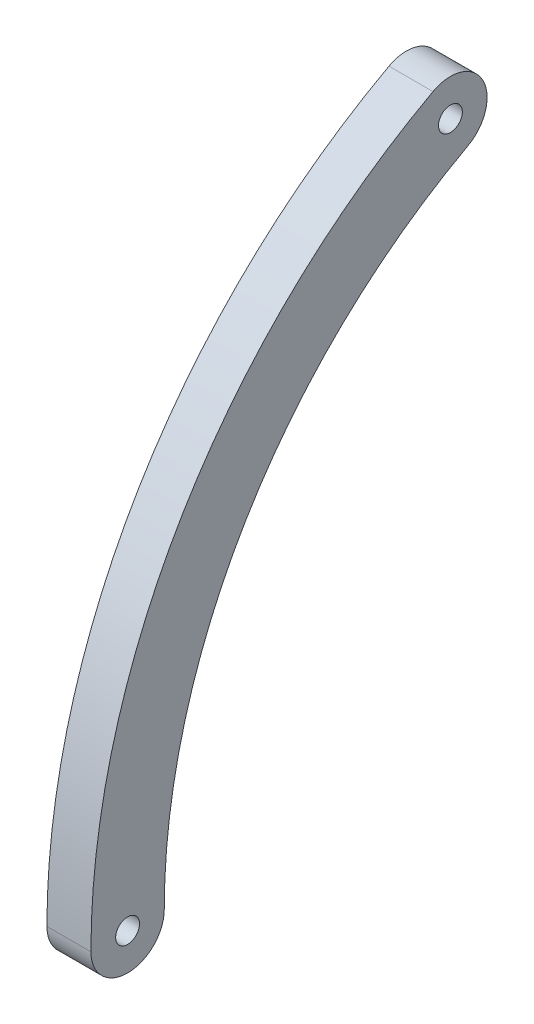
ISO-10303-21;
HEADER;
FILE_DESCRIPTION(('STEP AP214'),'2;1');
FILE_NAME('part.step','',(''),(''),'','','');
FILE_SCHEMA(('AUTOMOTIVE_DESIGN { 1 0 10303 214 1 1 1 1 }'));
ENDSEC;
DATA;
#1=APPLICATION_CONTEXT('core data for automotive mechanical design processes');
#2=APPLICATION_PROTOCOL_DEFINITION('international standard','automotive_design',2000,#1);
#3=PRODUCT_CONTEXT('',#1,'mechanical');
#4=PRODUCT('Part','Part','',(#3));
#5=PRODUCT_RELATED_PRODUCT_CATEGORY('part','',(#4));
#6=PRODUCT_DEFINITION_FORMATION('','',#4);
#7=PRODUCT_DEFINITION_CONTEXT('part definition',#1,'design');
#8=PRODUCT_DEFINITION('design','',#6,#7);
#9=PRODUCT_DEFINITION_SHAPE('','',#8);
#10=(LENGTH_UNIT() NAMED_UNIT(*) SI_UNIT(.MILLI.,.METRE.));
#11=(NAMED_UNIT(*) PLANE_ANGLE_UNIT() SI_UNIT($,.RADIAN.));
#12=(NAMED_UNIT(*) SI_UNIT($,.STERADIAN.) SOLID_ANGLE_UNIT());
#13=UNCERTAINTY_MEASURE_WITH_UNIT(LENGTH_MEASURE(1.E-05),#10,'distance_accuracy_value','');
#14=(GEOMETRIC_REPRESENTATION_CONTEXT(3) GLOBAL_UNCERTAINTY_ASSIGNED_CONTEXT((#13)) GLOBAL_UNIT_ASSIGNED_CONTEXT((#10,
#11,#12)) REPRESENTATION_CONTEXT('',''));
#15=CARTESIAN_POINT('',(0.,0.,0.));
#16=DIRECTION('',(0.,0.,1.));
#17=DIRECTION('',(1.,0.,0.));
#18=AXIS2_PLACEMENT_3D('',#15,#16,#17);
#19=CARTESIAN_POINT('',(3.81,0.,26.67));
#20=DIRECTION('',(1.,0.,0.));
#21=DIRECTION('',(0.,0.,-1.));
#22=AXIS2_PLACEMENT_3D('',#19,#20,#21);
#23=PLANE('',#22);
#24=CARTESIAN_POINT('',(3.81,46.9122949666017,25.3848809523809));
#25=DIRECTION('',(1.,0.,0.));
#26=DIRECTION('',(0.,0.,-1.));
#27=AXIS2_PLACEMENT_3D('',#24,#25,#26);
#28=CIRCLE('',#27,1.03187500000001);
#29=CARTESIAN_POINT('',(3.81,46.9122949666017,24.3530059523809));
#30=VERTEX_POINT('',#29);
#31=EDGE_CURVE('E102',#30,#30,#28,.T.);
#32=ORIENTED_EDGE('',*,*,#31,.F.);
#33=EDGE_LOOP('',(#32));
#34=FACE_BOUND('',#33,.T.);
#35=CARTESIAN_POINT('',(3.81,0.,53.34));
#36=DIRECTION('',(1.,0.,0.));
#37=DIRECTION('',(0.,0.,-1.));
#38=AXIS2_PLACEMENT_3D('',#35,#36,#37);
#39=CIRCLE('',#38,3.17499999999999);
#40=CARTESIAN_POINT('',(3.81,0.,56.515));
#41=VERTEX_POINT('',#40);
#42=CARTESIAN_POINT('',(3.81,0.,50.165));
#43=VERTEX_POINT('',#42);
#44=EDGE_CURVE('E87',#41,#43,#39,.T.);
#45=ORIENTED_EDGE('',*,*,#44,.T.);
#46=CARTESIAN_POINT('',(3.81,0.,0.));
#47=DIRECTION('',(-1.,0.,0.));
#48=DIRECTION('',(0.,0.,1.));
#49=AXIS2_PLACEMENT_3D('',#46,#47,#48);
#50=CIRCLE('',#49,50.165);
#51=CARTESIAN_POINT('',(3.81,44.119896456685,23.8738761337868));
#52=VERTEX_POINT('',#51);
#53=EDGE_CURVE('E82',#43,#52,#50,.T.);
#54=ORIENTED_EDGE('',*,*,#53,.T.);
#55=CARTESIAN_POINT('',(3.81,46.9122949666017,25.3848809523809));
#56=DIRECTION('',(1.,0.,0.));
#57=DIRECTION('',(0.,0.,-1.));
#58=AXIS2_PLACEMENT_3D('',#55,#56,#57);
#59=CIRCLE('',#58,3.175);
#60=CARTESIAN_POINT('',(3.81,49.7046934765185,26.895885770975));
#61=VERTEX_POINT('',#60);
#62=EDGE_CURVE('E85',#52,#61,#59,.T.);
#63=ORIENTED_EDGE('',*,*,#62,.T.);
#64=CARTESIAN_POINT('',(3.81,0.,0.));
#65=DIRECTION('',(1.,0.,0.));
#66=DIRECTION('',(0.,0.,1.));
#67=AXIS2_PLACEMENT_3D('',#64,#65,#66);
#68=CIRCLE('',#67,56.515);
#69=EDGE_CURVE('E52',#61,#41,#68,.T.);
#70=ORIENTED_EDGE('',*,*,#69,.T.);
#71=EDGE_LOOP('',(#45,#54,#63,#70));
#72=FACE_BOUND('',#71,.T.);
#73=CARTESIAN_POINT('',(3.81,0.,53.34));
#74=DIRECTION('',(1.,0.,0.));
#75=DIRECTION('',(0.,0.,-1.));
#76=AXIS2_PLACEMENT_3D('',#73,#74,#75);
#77=CIRCLE('',#76,1.031875);
#78=CARTESIAN_POINT('',(3.81,0.,52.308125));
#79=VERTEX_POINT('',#78);
#80=EDGE_CURVE('E117',#79,#79,#77,.T.);
#81=ORIENTED_EDGE('',*,*,#80,.F.);
#82=EDGE_LOOP('',(#81));
#83=FACE_BOUND('',#82,.T.);
#84=ADVANCED_FACE('F35',(#34,#72,#83),#23,.T.);
#85=CARTESIAN_POINT('',(0.,0.,26.67));
#86=DIRECTION('',(1.,0.,0.));
#87=DIRECTION('',(0.,0.,-1.));
#88=AXIS2_PLACEMENT_3D('',#85,#86,#87);
#89=PLANE('',#88);
#90=CARTESIAN_POINT('',(0.,0.,53.34));
#91=DIRECTION('',(1.,0.,0.));
#92=DIRECTION('',(0.,0.,-1.));
#93=AXIS2_PLACEMENT_3D('',#90,#91,#92);
#94=CIRCLE('',#93,3.17499999999999);
#95=CARTESIAN_POINT('',(0.,0.,56.515));
#96=VERTEX_POINT('',#95);
#97=CARTESIAN_POINT('',(0.,0.,50.165));
#98=VERTEX_POINT('',#97);
#99=EDGE_CURVE('E99',#96,#98,#94,.T.);
#100=ORIENTED_EDGE('',*,*,#99,.F.);
#101=CARTESIAN_POINT('',(0.,0.,0.));
#102=DIRECTION('',(1.,0.,0.));
#103=DIRECTION('',(0.,0.,1.));
#104=AXIS2_PLACEMENT_3D('',#101,#102,#103);
#105=CIRCLE('',#104,56.515);
#106=CARTESIAN_POINT('',(0.,49.7046934765185,26.895885770975));
#107=VERTEX_POINT('',#106);
#108=EDGE_CURVE('E75',#107,#96,#105,.T.);
#109=ORIENTED_EDGE('',*,*,#108,.F.);
#110=CARTESIAN_POINT('',(0.,46.9122949666017,25.3848809523809));
#111=DIRECTION('',(1.,0.,0.));
#112=DIRECTION('',(0.,0.,-1.));
#113=AXIS2_PLACEMENT_3D('',#110,#111,#112);
#114=CIRCLE('',#113,3.175);
#115=CARTESIAN_POINT('',(0.,44.119896456685,23.8738761337868));
#116=VERTEX_POINT('',#115);
#117=EDGE_CURVE('E69',#116,#107,#114,.T.);
#118=ORIENTED_EDGE('',*,*,#117,.F.);
#119=CARTESIAN_POINT('',(0.,0.,0.));
#120=DIRECTION('',(-1.,0.,0.));
#121=DIRECTION('',(0.,0.,1.));
#122=AXIS2_PLACEMENT_3D('',#119,#120,#121);
#123=CIRCLE('',#122,50.165);
#124=EDGE_CURVE('E91',#98,#116,#123,.T.);
#125=ORIENTED_EDGE('',*,*,#124,.F.);
#126=EDGE_LOOP('',(#100,#109,#118,#125));
#127=FACE_BOUND('',#126,.T.);
#128=CARTESIAN_POINT('',(0.,46.9122949666017,25.3848809523809));
#129=DIRECTION('',(1.,0.,0.));
#130=DIRECTION('',(0.,0.,-1.));
#131=AXIS2_PLACEMENT_3D('',#128,#129,#130);
#132=CIRCLE('',#131,1.03187500000001);
#133=CARTESIAN_POINT('',(0.,46.9122949666017,24.3530059523809));
#134=VERTEX_POINT('',#133);
#135=EDGE_CURVE('E114',#134,#134,#132,.T.);
#136=ORIENTED_EDGE('',*,*,#135,.T.);
#137=EDGE_LOOP('',(#136));
#138=FACE_BOUND('',#137,.T.);
#139=CARTESIAN_POINT('',(0.,0.,53.34));
#140=DIRECTION('',(1.,0.,0.));
#141=DIRECTION('',(0.,0.,-1.));
#142=AXIS2_PLACEMENT_3D('',#139,#140,#141);
#143=CIRCLE('',#142,1.031875);
#144=CARTESIAN_POINT('',(0.,0.,52.308125));
#145=VERTEX_POINT('',#144);
#146=EDGE_CURVE('E120',#145,#145,#143,.T.);
#147=ORIENTED_EDGE('',*,*,#146,.T.);
#148=EDGE_LOOP('',(#147));
#149=FACE_BOUND('',#148,.T.);
#150=ADVANCED_FACE('F110',(#127,#138,#149),#89,.F.);
#151=CARTESIAN_POINT('',(3.81,0.,53.34));
#152=DIRECTION('',(-1.,0.,0.));
#153=DIRECTION('',(0.,0.,1.));
#154=AXIS2_PLACEMENT_3D('',#151,#152,#153);
#155=CYLINDRICAL_SURFACE('',#154,3.17499999999999);
#156=ORIENTED_EDGE('',*,*,#99,.T.);
#157=DIRECTION('',(-1.,0.,0.));
#158=VECTOR('',#157,1.);
#159=CARTESIAN_POINT('',(3.81,0.,50.165));
#160=LINE('',#159,#158);
#161=EDGE_CURVE('E11',#43,#98,#160,.T.);
#162=ORIENTED_EDGE('',*,*,#161,.F.);
#163=ORIENTED_EDGE('',*,*,#44,.F.);
#164=DIRECTION('',(-1.,0.,0.));
#165=VECTOR('',#164,1.);
#166=CARTESIAN_POINT('',(3.81,0.,56.515));
#167=LINE('',#166,#165);
#168=EDGE_CURVE('E95',#41,#96,#167,.T.);
#169=ORIENTED_EDGE('',*,*,#168,.T.);
#170=EDGE_LOOP('',(#156,#162,#163,#169));
#171=FACE_BOUND('',#170,.T.);
#172=ADVANCED_FACE('F37',(#171),#155,.T.);
#173=CARTESIAN_POINT('',(3.81,0.,0.));
#174=DIRECTION('',(-1.,0.,0.));
#175=DIRECTION('',(0.,0.,1.));
#176=AXIS2_PLACEMENT_3D('',#173,#174,#175);
#177=CYLINDRICAL_SURFACE('',#176,50.165);
#178=ORIENTED_EDGE('',*,*,#124,.T.);
#179=DIRECTION('',(-1.,0.,0.));
#180=VECTOR('',#179,1.);
#181=CARTESIAN_POINT('',(3.81,44.119896456685,23.8738761337868));
#182=LINE('',#181,#180);
#183=EDGE_CURVE('E44',#52,#116,#182,.T.);
#184=ORIENTED_EDGE('',*,*,#183,.F.);
#185=ORIENTED_EDGE('',*,*,#53,.F.);
#186=ORIENTED_EDGE('',*,*,#161,.T.);
#187=EDGE_LOOP('',(#178,#184,#185,#186));
#188=FACE_BOUND('',#187,.T.);
#189=ADVANCED_FACE('F90',(#188),#177,.F.);
#190=CARTESIAN_POINT('',(3.81,46.9122949666017,25.3848809523809));
#191=DIRECTION('',(-1.,0.,0.));
#192=DIRECTION('',(0.,0.,1.));
#193=AXIS2_PLACEMENT_3D('',#190,#191,#192);
#194=CYLINDRICAL_SURFACE('',#193,3.175);
#195=ORIENTED_EDGE('',*,*,#117,.T.);
#196=DIRECTION('',(-1.,0.,0.));
#197=VECTOR('',#196,1.);
#198=CARTESIAN_POINT('',(3.81,49.7046934765185,26.895885770975));
#199=LINE('',#198,#197);
#200=EDGE_CURVE('E92',#61,#107,#199,.T.);
#201=ORIENTED_EDGE('',*,*,#200,.F.);
#202=ORIENTED_EDGE('',*,*,#62,.F.);
#203=ORIENTED_EDGE('',*,*,#183,.T.);
#204=EDGE_LOOP('',(#195,#201,#202,#203));
#205=FACE_BOUND('',#204,.T.);
#206=ADVANCED_FACE('F93',(#205),#194,.T.);
#207=CARTESIAN_POINT('',(3.81,0.,0.));
#208=DIRECTION('',(-1.,0.,0.));
#209=DIRECTION('',(0.,0.,1.));
#210=AXIS2_PLACEMENT_3D('',#207,#208,#209);
#211=CYLINDRICAL_SURFACE('',#210,56.515);
#212=ORIENTED_EDGE('',*,*,#108,.T.);
#213=ORIENTED_EDGE('',*,*,#168,.F.);
#214=ORIENTED_EDGE('',*,*,#69,.F.);
#215=ORIENTED_EDGE('',*,*,#200,.T.);
#216=EDGE_LOOP('',(#212,#213,#214,#215));
#217=FACE_BOUND('',#216,.T.);
#218=ADVANCED_FACE('F107',(#217),#211,.T.);
#219=CARTESIAN_POINT('',(3.81,46.9122949666017,25.3848809523809));
#220=DIRECTION('',(-1.,0.,0.));
#221=DIRECTION('',(0.,0.,1.));
#222=AXIS2_PLACEMENT_3D('',#219,#220,#221);
#223=CYLINDRICAL_SURFACE('',#222,1.03187500000001);
#224=ORIENTED_EDGE('',*,*,#31,.T.);
#225=EDGE_LOOP('',(#224));
#226=FACE_BOUND('',#225,.T.);
#227=ORIENTED_EDGE('',*,*,#135,.F.);
#228=EDGE_LOOP('',(#227));
#229=FACE_BOUND('',#228,.T.);
#230=ADVANCED_FACE('F137',(#226,#229),#223,.F.);
#231=CARTESIAN_POINT('',(3.81,0.,53.34));
#232=DIRECTION('',(-1.,0.,0.));
#233=DIRECTION('',(0.,0.,1.));
#234=AXIS2_PLACEMENT_3D('',#231,#232,#233);
#235=CYLINDRICAL_SURFACE('',#234,1.031875);
#236=ORIENTED_EDGE('',*,*,#80,.T.);
#237=EDGE_LOOP('',(#236));
#238=FACE_BOUND('',#237,.T.);
#239=ORIENTED_EDGE('',*,*,#146,.F.);
#240=EDGE_LOOP('',(#239));
#241=FACE_BOUND('',#240,.T.);
#242=ADVANCED_FACE('F126',(#238,#241),#235,.F.);
#243=CLOSED_SHELL('',(#84,#150,#172,#189,#206,#218,#230,#242));
#244=MANIFOLD_SOLID_BREP('B2',#243);
#245=ADVANCED_BREP_SHAPE_REPRESENTATION('',(#18,#244),#14);
#246=SHAPE_DEFINITION_REPRESENTATION(#9,#245);
ENDSEC;
END-ISO-10303-21;
